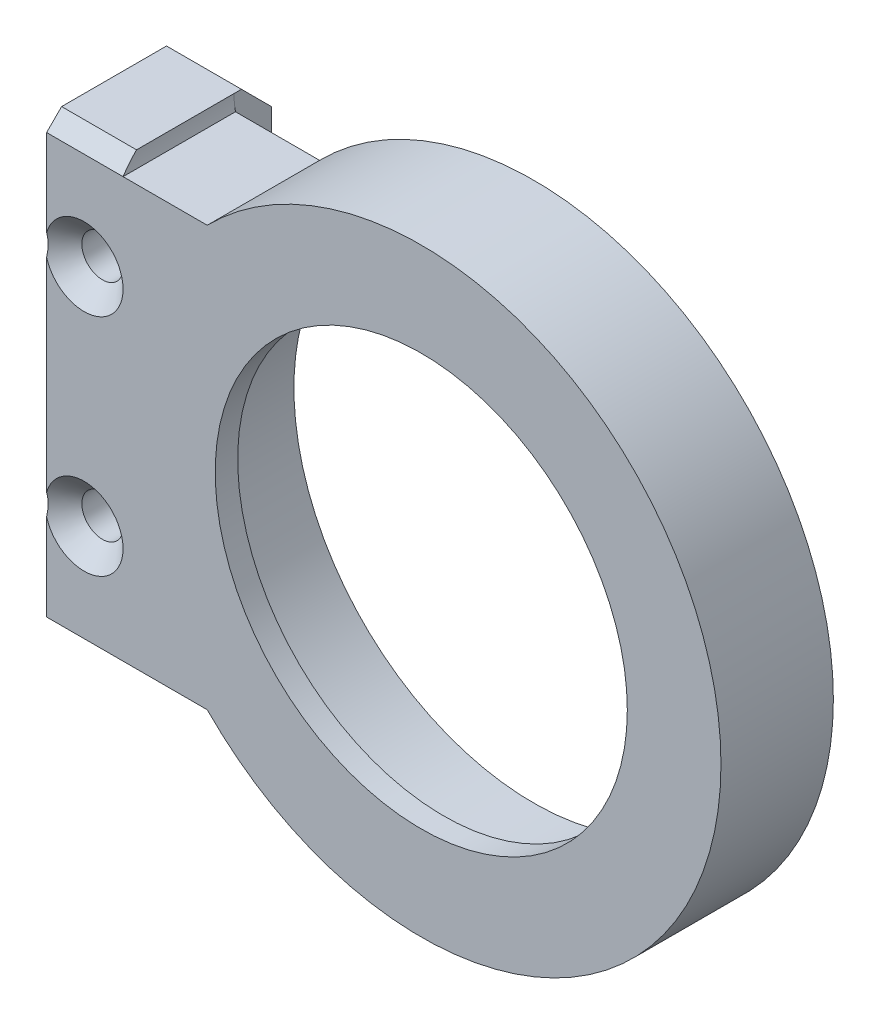
ISO-10303-21;
HEADER;
FILE_DESCRIPTION(('STEP AP214'),'2;1');
FILE_NAME('part.step','',(''),(''),'','','');
FILE_SCHEMA(('AUTOMOTIVE_DESIGN { 1 0 10303 214 1 1 1 1 }'));
ENDSEC;
DATA;
#1=APPLICATION_CONTEXT('core data for automotive mechanical design processes');
#2=APPLICATION_PROTOCOL_DEFINITION('international standard','automotive_design',2000,#1);
#3=PRODUCT_CONTEXT('',#1,'mechanical');
#4=PRODUCT('Part','Part','',(#3));
#5=PRODUCT_RELATED_PRODUCT_CATEGORY('part','',(#4));
#6=PRODUCT_DEFINITION_FORMATION('','',#4);
#7=PRODUCT_DEFINITION_CONTEXT('part definition',#1,'design');
#8=PRODUCT_DEFINITION('design','',#6,#7);
#9=PRODUCT_DEFINITION_SHAPE('','',#8);
#10=(LENGTH_UNIT() NAMED_UNIT(*) SI_UNIT(.MILLI.,.METRE.));
#11=(NAMED_UNIT(*) PLANE_ANGLE_UNIT() SI_UNIT($,.RADIAN.));
#12=(NAMED_UNIT(*) SI_UNIT($,.STERADIAN.) SOLID_ANGLE_UNIT());
#13=UNCERTAINTY_MEASURE_WITH_UNIT(LENGTH_MEASURE(1.E-05),#10,'distance_accuracy_value','');
#14=(GEOMETRIC_REPRESENTATION_CONTEXT(3) GLOBAL_UNCERTAINTY_ASSIGNED_CONTEXT((#13)) GLOBAL_UNIT_ASSIGNED_CONTEXT((#10,
#11,#12)) REPRESENTATION_CONTEXT('',''));
#15=CARTESIAN_POINT('',(0.,0.,0.));
#16=DIRECTION('',(0.,0.,1.));
#17=DIRECTION('',(1.,0.,0.));
#18=AXIS2_PLACEMENT_3D('',#15,#16,#17);
#19=CARTESIAN_POINT('',(0.,0.,15.));
#20=DIRECTION('',(0.,0.,-1.));
#21=DIRECTION('',(-1.,0.,0.));
#22=AXIS2_PLACEMENT_3D('',#19,#20,#21);
#23=PLANE('',#22);
#24=CARTESIAN_POINT('',(40.,40.,15.));
#25=DIRECTION('',(0.,0.,1.));
#26=DIRECTION('',(1.,0.,0.));
#27=AXIS2_PLACEMENT_3D('',#24,#25,#26);
#28=CIRCLE('',#27,27.5);
#29=CARTESIAN_POINT('',(67.5,40.,15.));
#30=VERTEX_POINT('',#29);
#31=EDGE_CURVE('E439',#30,#30,#28,.T.);
#32=ORIENTED_EDGE('',*,*,#31,.F.);
#33=EDGE_LOOP('',(#32));
#34=FACE_BOUND('',#33,.T.);
#35=CARTESIAN_POINT('',(40.,40.,15.));
#36=DIRECTION('',(0.,0.,1.));
#37=DIRECTION('',(1.,0.,0.));
#38=AXIS2_PLACEMENT_3D('',#35,#36,#37);
#39=CIRCLE('',#38,40.);
#40=CARTESIAN_POINT('',(11.4342862858286,12.,15.));
#41=VERTEX_POINT('',#40);
#42=CARTESIAN_POINT('',(11.4342862858286,68.,15.));
#43=VERTEX_POINT('',#42);
#44=EDGE_CURVE('E263',#41,#43,#39,.T.);
#45=ORIENTED_EDGE('',*,*,#44,.T.);
#46=DIRECTION('',(1.,0.,0.));
#47=VECTOR('',#46,1.);
#48=CARTESIAN_POINT('',(0.,68.,15.));
#49=LINE('',#48,#47);
#50=CARTESIAN_POINT('',(0.202041028867299,67.9999999999999,15.));
#51=VERTEX_POINT('',#50);
#52=EDGE_CURVE('E250',#51,#43,#49,.T.);
#53=ORIENTED_EDGE('',*,*,#52,.F.);
#54=DIRECTION('',(-1.,0.,0.));
#55=VECTOR('',#54,1.);
#56=CARTESIAN_POINT('',(-10.,68.,15.));
#57=LINE('',#56,#55);
#58=CARTESIAN_POINT('',(-10.,68.,15.));
#59=VERTEX_POINT('',#58);
#60=EDGE_CURVE('E259',#51,#59,#57,.T.);
#61=ORIENTED_EDGE('',*,*,#60,.T.);
#62=DIRECTION('',(0.,-1.,0.));
#63=VECTOR('',#62,1.);
#64=CARTESIAN_POINT('',(-10.,70.,15.));
#65=LINE('',#64,#63);
#66=CARTESIAN_POINT('',(-10.,56.4282856857086,15.));
#67=VERTEX_POINT('',#66);
#68=EDGE_CURVE('E427',#59,#67,#65,.T.);
#69=ORIENTED_EDGE('',*,*,#68,.T.);
#70=CARTESIAN_POINT('',(-5.,55.,15.));
#71=DIRECTION('',(0.,0.,1.));
#72=DIRECTION('',(1.,0.,0.));
#73=AXIS2_PLACEMENT_3D('',#70,#71,#72);
#74=CIRCLE('',#73,5.2);
#75=CARTESIAN_POINT('',(-10.,53.5717143142914,15.));
#76=VERTEX_POINT('',#75);
#77=EDGE_CURVE('E518',#76,#67,#74,.T.);
#78=ORIENTED_EDGE('',*,*,#77,.F.);
#79=CARTESIAN_POINT('',(-9.99999999999999,26.4282856857086,15.));
#80=VERTEX_POINT('',#79);
#81=EDGE_CURVE('E433',#76,#80,#65,.T.);
#82=ORIENTED_EDGE('',*,*,#81,.T.);
#83=CARTESIAN_POINT('',(-5.,25.,15.));
#84=DIRECTION('',(0.,0.,1.));
#85=DIRECTION('',(1.,0.,0.));
#86=AXIS2_PLACEMENT_3D('',#83,#84,#85);
#87=CIRCLE('',#86,5.2);
#88=CARTESIAN_POINT('',(-9.99999999999999,23.5717143142914,15.));
#89=VERTEX_POINT('',#88);
#90=EDGE_CURVE('E522',#89,#80,#87,.T.);
#91=ORIENTED_EDGE('',*,*,#90,.F.);
#92=CARTESIAN_POINT('',(-9.99999999999999,12.,15.));
#93=VERTEX_POINT('',#92);
#94=EDGE_CURVE('E434',#89,#93,#65,.T.);
#95=ORIENTED_EDGE('',*,*,#94,.T.);
#96=DIRECTION('',(1.,0.,0.));
#97=VECTOR('',#96,1.);
#98=CARTESIAN_POINT('',(0.,12.,15.));
#99=LINE('',#98,#97);
#100=CARTESIAN_POINT('',(0.202041028867287,12.,15.));
#101=VERTEX_POINT('',#100);
#102=EDGE_CURVE('E271',#93,#101,#99,.T.);
#103=ORIENTED_EDGE('',*,*,#102,.T.);
#104=DIRECTION('',(1.,0.,0.));
#105=VECTOR('',#104,1.);
#106=CARTESIAN_POINT('',(0.,12.,15.));
#107=LINE('',#106,#105);
#108=EDGE_CURVE('E550',#101,#41,#107,.T.);
#109=ORIENTED_EDGE('',*,*,#108,.T.);
#110=EDGE_LOOP('',(#45,#53,#61,#69,#78,#82,#91,#95,#103,#109));
#111=FACE_BOUND('',#110,.T.);
#112=ADVANCED_FACE('F115',(#34,#111),#23,.F.);
#113=CARTESIAN_POINT('',(0.,0.,0.));
#114=DIRECTION('',(0.,0.,-1.));
#115=DIRECTION('',(-1.,0.,0.));
#116=AXIS2_PLACEMENT_3D('',#113,#114,#115);
#117=PLANE('',#116);
#118=CARTESIAN_POINT('',(40.,40.,0.));
#119=DIRECTION('',(0.,0.,1.));
#120=DIRECTION('',(1.,0.,0.));
#121=AXIS2_PLACEMENT_3D('',#118,#119,#120);
#122=CIRCLE('',#121,32.);
#123=CARTESIAN_POINT('',(72.,40.,0.));
#124=VERTEX_POINT('',#123);
#125=EDGE_CURVE('E453',#124,#124,#122,.T.);
#126=ORIENTED_EDGE('',*,*,#125,.T.);
#127=EDGE_LOOP('',(#126));
#128=FACE_BOUND('',#127,.T.);
#129=DIRECTION('',(-1.,0.,0.));
#130=VECTOR('',#129,1.);
#131=CARTESIAN_POINT('',(0.,68.,0.));
#132=LINE('',#131,#130);
#133=CARTESIAN_POINT('',(11.4342862858286,68.,0.));
#134=VERTEX_POINT('',#133);
#135=CARTESIAN_POINT('',(0.202041028867299,67.9999999999999,0.));
#136=VERTEX_POINT('',#135);
#137=EDGE_CURVE('E252',#134,#136,#132,.T.);
#138=ORIENTED_EDGE('',*,*,#137,.F.);
#139=CARTESIAN_POINT('',(40.,40.,0.));
#140=DIRECTION('',(0.,0.,-1.));
#141=DIRECTION('',(-1.,0.,0.));
#142=AXIS2_PLACEMENT_3D('',#139,#140,#141);
#143=CIRCLE('',#142,40.);
#144=CARTESIAN_POINT('',(11.4342862858286,12.,0.));
#145=VERTEX_POINT('',#144);
#146=EDGE_CURVE('E12',#134,#145,#143,.T.);
#147=ORIENTED_EDGE('',*,*,#146,.T.);
#148=DIRECTION('',(-1.,0.,0.));
#149=VECTOR('',#148,1.);
#150=CARTESIAN_POINT('',(0.,12.,0.));
#151=LINE('',#150,#149);
#152=CARTESIAN_POINT('',(0.202041028867289,12.,0.));
#153=VERTEX_POINT('',#152);
#154=EDGE_CURVE('E416',#145,#153,#151,.T.);
#155=ORIENTED_EDGE('',*,*,#154,.T.);
#156=CARTESIAN_POINT('',(10.,10.,0.));
#157=DIRECTION('',(0.,0.,-1.));
#158=DIRECTION('',(-1.,0.,0.));
#159=AXIS2_PLACEMENT_3D('',#156,#157,#158);
#160=CIRCLE('',#159,10.);
#161=CARTESIAN_POINT('',(0.,10.,0.));
#162=VERTEX_POINT('',#161);
#163=EDGE_CURVE('E474',#162,#153,#160,.T.);
#164=ORIENTED_EDGE('',*,*,#163,.F.);
#165=DIRECTION('',(0.,-1.,0.));
#166=VECTOR('',#165,1.);
#167=CARTESIAN_POINT('',(0.,0.,0.));
#168=LINE('',#167,#166);
#169=CARTESIAN_POINT('',(0.,69.9999999999999,0.));
#170=VERTEX_POINT('',#169);
#171=EDGE_CURVE('E460',#170,#162,#168,.T.);
#172=ORIENTED_EDGE('',*,*,#171,.F.);
#173=CARTESIAN_POINT('',(10.,70.,0.));
#174=DIRECTION('',(0.,0.,-1.));
#175=DIRECTION('',(-1.,0.,0.));
#176=AXIS2_PLACEMENT_3D('',#173,#174,#175);
#177=CIRCLE('',#176,10.);
#178=EDGE_CURVE('E472',#136,#170,#177,.T.);
#179=ORIENTED_EDGE('',*,*,#178,.F.);
#180=EDGE_LOOP('',(#138,#147,#155,#164,#172,#179));
#181=FACE_BOUND('',#180,.T.);
#182=ADVANCED_FACE('F345',(#128,#181),#117,.T.);
#183=CARTESIAN_POINT('',(40.,40.,0.));
#184=DIRECTION('',(0.,0.,1.));
#185=DIRECTION('',(1.,0.,0.));
#186=AXIS2_PLACEMENT_3D('',#183,#184,#185);
#187=CYLINDRICAL_SURFACE('',#186,32.);
#188=ORIENTED_EDGE('',*,*,#125,.F.);
#189=EDGE_LOOP('',(#188));
#190=FACE_BOUND('',#189,.T.);
#191=CARTESIAN_POINT('',(40.,40.,12.));
#192=DIRECTION('',(0.,0.,1.));
#193=DIRECTION('',(1.,0.,0.));
#194=AXIS2_PLACEMENT_3D('',#191,#192,#193);
#195=CIRCLE('',#194,32.);
#196=CARTESIAN_POINT('',(72.,40.,12.));
#197=VERTEX_POINT('',#196);
#198=EDGE_CURVE('E464',#197,#197,#195,.F.);
#199=ORIENTED_EDGE('',*,*,#198,.F.);
#200=EDGE_LOOP('',(#199));
#201=FACE_BOUND('',#200,.T.);
#202=ADVANCED_FACE('F341',(#190,#201),#187,.F.);
#203=CARTESIAN_POINT('',(40.,40.,12.));
#204=DIRECTION('',(0.,0.,1.));
#205=DIRECTION('',(1.,0.,0.));
#206=AXIS2_PLACEMENT_3D('',#203,#204,#205);
#207=PLANE('',#206);
#208=CARTESIAN_POINT('',(40.,40.,12.));
#209=DIRECTION('',(0.,0.,1.));
#210=DIRECTION('',(1.,0.,0.));
#211=AXIS2_PLACEMENT_3D('',#208,#209,#210);
#212=CIRCLE('',#211,27.5);
#213=CARTESIAN_POINT('',(67.5,40.,12.));
#214=VERTEX_POINT('',#213);
#215=EDGE_CURVE('E449',#214,#214,#212,.T.);
#216=ORIENTED_EDGE('',*,*,#215,.T.);
#217=EDGE_LOOP('',(#216));
#218=FACE_BOUND('',#217,.T.);
#219=ORIENTED_EDGE('',*,*,#198,.T.);
#220=EDGE_LOOP('',(#219));
#221=FACE_BOUND('',#220,.T.);
#222=ADVANCED_FACE('F337',(#218,#221),#207,.F.);
#223=CARTESIAN_POINT('',(40.,40.,12.));
#224=DIRECTION('',(0.,0.,1.));
#225=DIRECTION('',(1.,0.,0.));
#226=AXIS2_PLACEMENT_3D('',#223,#224,#225);
#227=CYLINDRICAL_SURFACE('',#226,27.5);
#228=ORIENTED_EDGE('',*,*,#215,.F.);
#229=EDGE_LOOP('',(#228));
#230=FACE_BOUND('',#229,.T.);
#231=ORIENTED_EDGE('',*,*,#31,.T.);
#232=EDGE_LOOP('',(#231));
#233=FACE_BOUND('',#232,.T.);
#234=ADVANCED_FACE('F333',(#230,#233),#227,.F.);
#235=CARTESIAN_POINT('',(0.,69.9999999999999,-5.));
#236=DIRECTION('',(1.,0.,0.));
#237=DIRECTION('',(0.,0.,-1.));
#238=AXIS2_PLACEMENT_3D('',#235,#236,#237);
#239=PLANE('',#238);
#240=DIRECTION('',(0.,0.,1.));
#241=VECTOR('',#240,1.);
#242=CARTESIAN_POINT('',(0.,10.,-5.));
#243=LINE('',#242,#241);
#244=CARTESIAN_POINT('',(0.,10.,-1.00000000000001));
#245=VERTEX_POINT('',#244);
#246=EDGE_CURVE('E435',#245,#162,#243,.T.);
#247=ORIENTED_EDGE('',*,*,#246,.F.);
#248=DIRECTION('',(0.,-0.707106781186549,0.707106781186546));
#249=VECTOR('',#248,1.);
#250=CARTESIAN_POINT('',(0.,42.0000000000001,-33.));
#251=LINE('',#250,#249);
#252=CARTESIAN_POINT('',(0.,14.,-5.));
#253=VERTEX_POINT('',#252);
#254=EDGE_CURVE('E479',#245,#253,#251,.F.);
#255=ORIENTED_EDGE('',*,*,#254,.T.);
#256=DIRECTION('',(0.,1.,0.));
#257=VECTOR('',#256,1.);
#258=CARTESIAN_POINT('',(0.,69.9999999999999,-5.));
#259=LINE('',#258,#257);
#260=CARTESIAN_POINT('',(0.,65.9999999999999,-5.));
#261=VERTEX_POINT('',#260);
#262=EDGE_CURVE('E421',#253,#261,#259,.T.);
#263=ORIENTED_EDGE('',*,*,#262,.T.);
#264=DIRECTION('',(0.,-0.707106781186548,-0.707106781186548));
#265=VECTOR('',#264,1.);
#266=CARTESIAN_POINT('',(0.,67.9999999999999,-3.00000000000001));
#267=LINE('',#266,#265);
#268=CARTESIAN_POINT('',(0.,69.9999999999999,-1.00000000000001));
#269=VERTEX_POINT('',#268);
#270=EDGE_CURVE('E477',#261,#269,#267,.F.);
#271=ORIENTED_EDGE('',*,*,#270,.T.);
#272=DIRECTION('',(0.,0.,1.));
#273=VECTOR('',#272,1.);
#274=CARTESIAN_POINT('',(0.,69.9999999999999,-5.));
#275=LINE('',#274,#273);
#276=EDGE_CURVE('E425',#269,#170,#275,.T.);
#277=ORIENTED_EDGE('',*,*,#276,.T.);
#278=ORIENTED_EDGE('',*,*,#171,.T.);
#279=EDGE_LOOP('',(#247,#255,#263,#271,#277,#278));
#280=FACE_BOUND('',#279,.T.);
#281=ADVANCED_FACE('F330',(#280),#239,.T.);
#282=CARTESIAN_POINT('',(0.,10.,-5.));
#283=DIRECTION('',(0.,-1.,0.));
#284=DIRECTION('',(0.,0.,-1.));
#285=AXIS2_PLACEMENT_3D('',#282,#283,#284);
#286=PLANE('',#285);
#287=DIRECTION('',(0.,0.,1.));
#288=VECTOR('',#287,1.);
#289=CARTESIAN_POINT('',(-9.99999999999999,10.,-5.));
#290=LINE('',#289,#288);
#291=CARTESIAN_POINT('',(-9.99999999999999,10.,-1.00000000000001));
#292=VERTEX_POINT('',#291);
#293=CARTESIAN_POINT('',(-9.99999999999999,10.,13.));
#294=VERTEX_POINT('',#293);
#295=EDGE_CURVE('E440',#292,#294,#290,.T.);
#296=ORIENTED_EDGE('',*,*,#295,.F.);
#297=DIRECTION('',(1.,0.,0.));
#298=VECTOR('',#297,1.);
#299=CARTESIAN_POINT('',(0.,10.,-1.00000000000001));
#300=LINE('',#299,#298);
#301=EDGE_CURVE('E386',#292,#245,#300,.T.);
#302=ORIENTED_EDGE('',*,*,#301,.T.);
#303=ORIENTED_EDGE('',*,*,#246,.T.);
#304=DIRECTION('',(0.,0.,-1.));
#305=VECTOR('',#304,1.);
#306=CARTESIAN_POINT('',(0.,10.,15.));
#307=LINE('',#306,#305);
#308=CARTESIAN_POINT('',(0.,10.,13.));
#309=VERTEX_POINT('',#308);
#310=EDGE_CURVE('E272',#162,#309,#307,.F.);
#311=ORIENTED_EDGE('',*,*,#310,.T.);
#312=DIRECTION('',(-1.,0.,0.));
#313=VECTOR('',#312,1.);
#314=CARTESIAN_POINT('',(-9.99999999999999,10.,13.));
#315=LINE('',#314,#313);
#316=EDGE_CURVE('E277',#309,#294,#315,.T.);
#317=ORIENTED_EDGE('',*,*,#316,.T.);
#318=EDGE_LOOP('',(#296,#302,#303,#311,#317));
#319=FACE_BOUND('',#318,.T.);
#320=ADVANCED_FACE('F322',(#319),#286,.T.);
#321=CARTESIAN_POINT('',(-10.,70.,-5.));
#322=DIRECTION('',(-1.,0.,0.));
#323=DIRECTION('',(0.,-1.,0.));
#324=AXIS2_PLACEMENT_3D('',#321,#322,#323);
#325=PLANE('',#324);
#326=CARTESIAN_POINT('',(-10.,40.,-15.));
#327=DIRECTION('',(-1.,0.,0.));
#328=DIRECTION('',(0.,-1.,0.));
#329=AXIS2_PLACEMENT_3D('',#326,#327,#328);
#330=CIRCLE('',#329,15.);
#331=CARTESIAN_POINT('',(-9.99999999999999,28.8196601125011,-5.));
#332=VERTEX_POINT('',#331);
#333=CARTESIAN_POINT('',(-10.,51.180339887499,-5.));
#334=VERTEX_POINT('',#333);
#335=EDGE_CURVE('E407',#332,#334,#330,.T.);
#336=ORIENTED_EDGE('',*,*,#335,.F.);
#337=DIRECTION('',(0.,-1.,0.));
#338=VECTOR('',#337,1.);
#339=CARTESIAN_POINT('',(-10.,70.,-5.));
#340=LINE('',#339,#338);
#341=CARTESIAN_POINT('',(-9.99999999999999,14.,-5.));
#342=VERTEX_POINT('',#341);
#343=EDGE_CURVE('E412',#332,#342,#340,.T.);
#344=ORIENTED_EDGE('',*,*,#343,.T.);
#345=DIRECTION('',(0.,0.707106781186549,-0.707106781186546));
#346=VECTOR('',#345,1.);
#347=CARTESIAN_POINT('',(-10.,42.0000000000001,-33.));
#348=LINE('',#347,#346);
#349=EDGE_CURVE('E382',#342,#292,#348,.F.);
#350=ORIENTED_EDGE('',*,*,#349,.T.);
#351=ORIENTED_EDGE('',*,*,#295,.T.);
#352=DIRECTION('',(0.,0.707106781186545,0.70710678118655));
#353=VECTOR('',#352,1.);
#354=CARTESIAN_POINT('',(-9.99999999999999,30.9999999999998,33.9999999999999));
#355=LINE('',#354,#353);
#356=EDGE_CURVE('E288',#294,#93,#355,.T.);
#357=ORIENTED_EDGE('',*,*,#356,.T.);
#358=ORIENTED_EDGE('',*,*,#94,.F.);
#359=CARTESIAN_POINT('',(-9.99999999999999,7.8594311095646,27.6549461463137));
#360=CARTESIAN_POINT('',(-9.99999999999999,8.28416255769191,27.2472450098931));
#361=CARTESIAN_POINT('',(-9.99999999999999,8.70945387927048,26.8401244323223));
#362=CARTESIAN_POINT('',(-9.99999999999999,9.56154487950488,26.0274201074976));
#363=CARTESIAN_POINT('',(-9.99999999999999,9.98834463672727,25.621836442643));
#364=CARTESIAN_POINT('',(-9.99999999999999,10.8449804498971,24.8115046932619));
#365=CARTESIAN_POINT('',(-9.99999999999999,11.2748216406091,24.4067620307531));
#366=CARTESIAN_POINT('',(-9.99999999999999,12.1368987880679,23.5998676629642));
#367=CARTESIAN_POINT('',(-9.99999999999999,12.5691346513957,23.197715857917));
#368=CARTESIAN_POINT('',(-9.99999999999999,13.4885147936776,22.3490700908305));
#369=CARTESIAN_POINT('',(-9.99999999999999,13.9760592526751,21.9030082340218));
#370=CARTESIAN_POINT('',(-9.99999999999999,14.7116102588215,21.2385324689809));
#371=CARTESIAN_POINT('',(-9.99999999999999,14.9575171457645,21.0177946400969));
#372=CARTESIAN_POINT('',(-9.99999999999999,15.4510302057701,20.5782281112408));
#373=CARTESIAN_POINT('',(-9.99999999999999,15.6986363664522,20.3593993973858));
#374=CARTESIAN_POINT('',(-9.99999999999999,16.1955173969748,19.9244510156428));
#375=CARTESIAN_POINT('',(-9.99999999999999,16.4447889484435,19.7083275616086));
#376=CARTESIAN_POINT('',(-9.99999999999999,16.9458689452639,19.2790457830003));
#377=CARTESIAN_POINT('',(-9.99999999999999,17.1976773410219,19.0658874006541));
#378=CARTESIAN_POINT('',(-9.99999999999999,17.7044132236852,18.643415990683));
#379=CARTESIAN_POINT('',(-9.99999999999999,17.9593400233216,18.4341021403176));
#380=CARTESIAN_POINT('',(-9.99999999999999,18.4731945565331,18.0204556387426));
#381=CARTESIAN_POINT('',(-9.99999999999999,18.7321220149816,17.8161226474669));
#382=CARTESIAN_POINT('',(-9.99999999999999,19.1611358397914,17.4864100174417));
#383=CARTESIAN_POINT('',(-9.99999999999999,19.3297005004632,17.3590520620378));
#384=CARTESIAN_POINT('',(-9.99999999999999,19.6693493609622,17.107719744443));
#385=CARTESIAN_POINT('',(-9.99999999999999,19.8404336387524,16.983745487292));
#386=CARTESIAN_POINT('',(-9.99999999999999,20.1858986855652,16.7397826427711));
#387=CARTESIAN_POINT('',(-9.99999999999999,20.3602848967737,16.6198017353629));
#388=CARTESIAN_POINT('',(-9.99999999999999,20.7126109548291,16.3851670625989));
#389=CARTESIAN_POINT('',(-9.99999999999999,20.8905506395272,16.2705130549616));
#390=CARTESIAN_POINT('',(-9.99999999999999,21.2469861864799,16.0502699042189));
#391=CARTESIAN_POINT('',(-9.99999999999999,21.4253968392505,15.9445436578861));
#392=CARTESIAN_POINT('',(-9.99999999999999,21.7870157213599,15.7414541593591));
#393=CARTESIAN_POINT('',(-9.99999999999999,21.9702251235772,15.6440929770623));
#394=CARTESIAN_POINT('',(-9.99999999999999,22.3414952285317,15.4605376181867));
#395=CARTESIAN_POINT('',(-9.99999999999999,22.5295390328312,15.3743095853939));
#396=CARTESIAN_POINT('',(-9.99999999999999,22.9114037054313,15.2159134799892));
#397=CARTESIAN_POINT('',(-9.99999999999999,23.1052198338,15.1437342193307));
#398=CARTESIAN_POINT('',(-9.99999999999999,23.4262429895185,15.0405016336706));
#399=CARTESIAN_POINT('',(-9.99999999999999,23.5517278424753,15.0040867135263));
#400=CARTESIAN_POINT('',(-9.99999999999999,23.8048177777684,14.9394064611319));
#401=CARTESIAN_POINT('',(-9.99999999999999,23.9324230517172,14.911141869671));
#402=CARTESIAN_POINT('',(-9.99999999999999,24.1889904485045,14.8637825558888));
#403=CARTESIAN_POINT('',(-9.99999999999999,24.317948049089,14.8446635967391));
#404=CARTESIAN_POINT('',(-9.99999999999999,24.5769371979581,14.8162150237997));
#405=CARTESIAN_POINT('',(-9.99999999999999,24.7069686792413,14.8068848038529));
#406=CARTESIAN_POINT('',(-9.99999999999999,24.9952754785205,14.7975090691851));
#407=CARTESIAN_POINT('',(-9.99999999999999,25.1536362005214,14.7998796347131));
#408=CARTESIAN_POINT('',(-9.99999999999999,25.4694279022083,14.8195120069197));
#409=CARTESIAN_POINT('',(-9.99999999999999,25.6268587450692,14.8367759526731));
#410=CARTESIAN_POINT('',(-9.99999999999999,25.9401910566238,14.8852616151982));
#411=CARTESIAN_POINT('',(-9.99999999999999,26.0960835558126,14.9165405263141));
#412=CARTESIAN_POINT('',(-9.99999999999999,26.4048316394755,14.9914455431218));
#413=CARTESIAN_POINT('',(-9.99999999999999,26.5576868552822,15.0350731380247));
#414=CARTESIAN_POINT('',(-9.99999999999999,27.0090455774692,15.1810262884109));
#415=CARTESIAN_POINT('',(-9.99999999999999,27.3025787273957,15.2988179616917));
#416=CARTESIAN_POINT('',(-9.99999999999999,27.7328660017739,15.4966944369798));
#417=CARTESIAN_POINT('',(-9.99999999999999,27.8747627325166,15.5662646766619));
#418=CARTESIAN_POINT('',(-9.99999999999999,28.1555395722183,15.7112584291149));
#419=CARTESIAN_POINT('',(-9.99999999999999,28.2944201095908,15.7866811035669));
#420=CARTESIAN_POINT('',(-9.99999999999999,28.5713999519271,15.9434253469254));
#421=CARTESIAN_POINT('',(-9.99999999999999,28.7094600280379,16.0248155762936));
#422=CARTESIAN_POINT('',(-9.99999999999999,28.9830997137161,16.1916607692821));
#423=CARTESIAN_POINT('',(-9.99999999999999,29.118679270874,16.2771158186487));
#424=CARTESIAN_POINT('',(-9.99999999999999,29.3875377590467,16.45131623394));
#425=CARTESIAN_POINT('',(-9.99999999999999,29.5208185378889,16.540058757526));
#426=CARTESIAN_POINT('',(-9.99999999999999,29.7854554942098,16.7203488625712));
#427=CARTESIAN_POINT('',(-9.99999999999999,29.9168117507728,16.8118963282864));
#428=CARTESIAN_POINT('',(-9.99999999999999,30.3471268087106,17.1175839376333));
#429=CARTESIAN_POINT('',(-9.99999999999999,30.6425226389314,17.3367415382127));
#430=CARTESIAN_POINT('',(-9.99999999999999,31.2268039042214,17.7835971372859));
#431=CARTESIAN_POINT('',(-9.99999999999999,31.5156880637803,18.0112967861245));
#432=CARTESIAN_POINT('',(-9.99999999999999,32.0886761063362,18.4729776871843));
#433=CARTESIAN_POINT('',(-10.,32.372776891414,18.7069627734305));
#434=CARTESIAN_POINT('',(-10.,32.9371353506225,19.1794642382185));
#435=CARTESIAN_POINT('',(-10.,33.2173933118146,19.4179802750851));
#436=CARTESIAN_POINT('',(-10.,33.775658574937,19.8991141453604));
#437=CARTESIAN_POINT('',(-10.,34.0536579240796,20.1417411890543));
#438=CARTESIAN_POINT('',(-10.,34.6072702282067,20.6297074979111));
#439=CARTESIAN_POINT('',(-10.,34.8828831441466,20.8750468073007));
#440=CARTESIAN_POINT('',(-10.,35.4320816152624,21.3677841351746));
#441=CARTESIAN_POINT('',(-10.,35.7056678636726,21.6151813818229));
#442=CARTESIAN_POINT('',(-10.,36.2512637596094,22.1117091411918));
#443=CARTESIAN_POINT('',(-10.,36.5232733998255,22.3608396619376));
#444=CARTESIAN_POINT('',(-10.,37.2709381009922,23.0491967140095));
#445=CARTESIAN_POINT('',(-10.,37.7452426863505,23.4898897526554));
#446=CARTESIAN_POINT('',(-10.,38.6909654434033,24.3744535138539));
#447=CARTESIAN_POINT('',(-10.,39.1623833121889,24.8183245596289));
#448=CARTESIAN_POINT('',(-10.,40.1006990436849,25.7062286205611));
#449=CARTESIAN_POINT('',(-10.,40.5676077360365,26.1502502010019));
#450=CARTESIAN_POINT('',(-10.,41.4996390215577,27.0400506973058));
#451=CARTESIAN_POINT('',(-10.,41.9647618262949,27.485829391481));
#452=CARTESIAN_POINT('',(-10.,42.4292534504211,27.9322606378525));
#453=B_SPLINE_CURVE_WITH_KNOTS('',3,(#359,#360,#361,#362,#363,#364,#365,#366,#367,#368,#369,
#370,#371,#372,#373,#374,#375,#376,#377,#378,#379,#380,#381,#382,#383,#384,#385,#386,#387,#388,
#389,#390,#391,#392,#393,#394,#395,#396,#397,#398,#399,#400,#401,#402,#403,#404,#405,#406,#407,
#408,#409,#410,#411,#412,#413,#414,#415,#416,#417,#418,#419,#420,#421,#422,#423,#424,#425,#426,
#427,#428,#429,#430,#431,#432,#433,#434,#435,#436,#437,#438,#439,#440,#441,#442,#443,#444,#445,
#446,#447,#448,#449,#450,#451,#452),.UNSPECIFIED.,.F.,.F.,(4,2,2,2,2,2,2,2,2,2,2,2,2,2,2,2,2,2,
2,2,2,2,2,2,2,2,2,2,2,2,2,2,2,2,2,2,2,2,2,2,2,2,2,2,2,2,4),(0.,1.76622786818039,3.5325491270969,
5.30376049243499,7.07490324048938,9.05729193480285,10.0486261729348,11.0399531961451,
12.0296882325512,13.0194039576862,14.0089053533404,14.9983390009097,15.6321095938035,
16.2658998384679,16.9008457795972,17.5357628133768,18.157742812893,18.779876277952,
19.4000708718358,20.0197695210031,20.4115253187975,20.8033167123486,21.1940639875419,
21.5847870647033,22.0591798013701,22.53364068446,23.0100557066807,23.4865282074962,
24.4327241030442,24.9067676938962,25.3807435063376,25.8614629525118,26.3421925438374,
26.8225157781252,27.3028192188247,28.4060062914135,29.5094076114018,30.6134979994025,
31.717505456796,32.8244445683253,33.9314017565347,35.0379609825212,36.1445253353222,
38.0868153871105,40.0293058699437,41.9622851597255,43.895027917229),.UNSPECIFIED.);
#454=EDGE_CURVE('E242',#80,#89,#453,.F.);
#455=ORIENTED_EDGE('',*,*,#454,.F.);
#456=ORIENTED_EDGE('',*,*,#81,.F.);
#457=CARTESIAN_POINT('',(-10.,37.8594311095646,27.6549461463137));
#458=CARTESIAN_POINT('',(-10.,38.2841625576919,27.2472450098931));
#459=CARTESIAN_POINT('',(-10.,38.7094538792705,26.8401244323223));
#460=CARTESIAN_POINT('',(-10.,39.5615448795049,26.0274201074976));
#461=CARTESIAN_POINT('',(-10.,39.9883446367273,25.621836442643));
#462=CARTESIAN_POINT('',(-10.,40.8449804498971,24.8115046932619));
#463=CARTESIAN_POINT('',(-10.,41.2748216406091,24.4067620307531));
#464=CARTESIAN_POINT('',(-10.,42.1368987880679,23.5998676629642));
#465=CARTESIAN_POINT('',(-10.,42.5691346513957,23.1977158579171));
#466=CARTESIAN_POINT('',(-10.,43.4885147936776,22.3490700908305));
#467=CARTESIAN_POINT('',(-10.,43.976059252675,21.9030082340219));
#468=CARTESIAN_POINT('',(-10.,44.7116102588215,21.238532468981));
#469=CARTESIAN_POINT('',(-10.,44.9575171457645,21.017794640097));
#470=CARTESIAN_POINT('',(-10.,45.45103020577,20.5782281112409));
#471=CARTESIAN_POINT('',(-10.,45.6986363664521,20.3593993973858));
#472=CARTESIAN_POINT('',(-10.,46.1955173969748,19.9244510156428));
#473=CARTESIAN_POINT('',(-10.,46.4447889484435,19.7083275616087));
#474=CARTESIAN_POINT('',(-10.,46.9458689452638,19.2790457830003));
#475=CARTESIAN_POINT('',(-10.,47.1976773410219,19.0658874006541));
#476=CARTESIAN_POINT('',(-10.,47.7044132236852,18.643415990683));
#477=CARTESIAN_POINT('',(-10.,47.9593400233216,18.4341021403176));
#478=CARTESIAN_POINT('',(-10.,48.473194556533,18.0204556387426));
#479=CARTESIAN_POINT('',(-10.,48.7321220149815,17.816122647467));
#480=CARTESIAN_POINT('',(-10.,49.1611358397913,17.4864100174417));
#481=CARTESIAN_POINT('',(-10.,49.3297005004632,17.3590520620378));
#482=CARTESIAN_POINT('',(-10.,49.6693493609622,17.107719744443));
#483=CARTESIAN_POINT('',(-10.,49.8404336387524,16.983745487292));
#484=CARTESIAN_POINT('',(-10.,50.1858986855651,16.7397826427711));
#485=CARTESIAN_POINT('',(-10.,50.3602848967737,16.6198017353629));
#486=CARTESIAN_POINT('',(-10.,50.7126109548291,16.3851670625989));
#487=CARTESIAN_POINT('',(-10.,50.8905506395271,16.2705130549616));
#488=CARTESIAN_POINT('',(-10.,51.2469861864799,16.0502699042189));
#489=CARTESIAN_POINT('',(-10.,51.4253968392505,15.9445436578861));
#490=CARTESIAN_POINT('',(-10.,51.7870157213599,15.7414541593591));
#491=CARTESIAN_POINT('',(-10.,51.9702251235772,15.6440929770623));
#492=CARTESIAN_POINT('',(-10.,52.3414952285317,15.4605376181867));
#493=CARTESIAN_POINT('',(-10.,52.5295390328312,15.3743095853939));
#494=CARTESIAN_POINT('',(-10.,52.9114037054313,15.2159134799892));
#495=CARTESIAN_POINT('',(-10.,53.1052198338,15.1437342193307));
#496=CARTESIAN_POINT('',(-10.,53.4262429895185,15.0405016336706));
#497=CARTESIAN_POINT('',(-10.,53.5517278424753,15.0040867135263));
#498=CARTESIAN_POINT('',(-10.,53.8048177777684,14.9394064611319));
#499=CARTESIAN_POINT('',(-10.,53.9324230517172,14.911141869671));
#500=CARTESIAN_POINT('',(-10.,54.1889904485045,14.8637825558888));
#501=CARTESIAN_POINT('',(-10.,54.317948049089,14.8446635967391));
#502=CARTESIAN_POINT('',(-10.,54.5769371979581,14.8162150237997));
#503=CARTESIAN_POINT('',(-10.,54.7069686792413,14.8068848038529));
#504=CARTESIAN_POINT('',(-10.,54.9952754785205,14.7975090691851));
#505=CARTESIAN_POINT('',(-10.,55.1536362005214,14.7998796347131));
#506=CARTESIAN_POINT('',(-10.,55.4694279022083,14.8195120069197));
#507=CARTESIAN_POINT('',(-10.,55.6268587450692,14.8367759526731));
#508=CARTESIAN_POINT('',(-10.,55.9401910566238,14.8852616151982));
#509=CARTESIAN_POINT('',(-10.,56.0960835558126,14.9165405263141));
#510=CARTESIAN_POINT('',(-10.,56.4048316394754,14.9914455431218));
#511=CARTESIAN_POINT('',(-10.,56.5576868552822,15.0350731380247));
#512=CARTESIAN_POINT('',(-10.,57.0090455774692,15.1810262884109));
#513=CARTESIAN_POINT('',(-10.,57.3025787273957,15.2988179616917));
#514=CARTESIAN_POINT('',(-10.,57.7328660017739,15.4966944369798));
#515=CARTESIAN_POINT('',(-10.,57.8747627325166,15.5662646766619));
#516=CARTESIAN_POINT('',(-10.,58.1555395722183,15.7112584291149));
#517=CARTESIAN_POINT('',(-10.,58.2944201095908,15.7866811035669));
#518=CARTESIAN_POINT('',(-10.,58.5713999519271,15.9434253469254));
#519=CARTESIAN_POINT('',(-10.,58.7094600280379,16.0248155762936));
#520=CARTESIAN_POINT('',(-10.,58.9830997137161,16.1916607692821));
#521=CARTESIAN_POINT('',(-10.,59.1186792708741,16.2771158186487));
#522=CARTESIAN_POINT('',(-10.,59.3875377590467,16.45131623394));
#523=CARTESIAN_POINT('',(-10.,59.5208185378889,16.540058757526));
#524=CARTESIAN_POINT('',(-10.,59.7854554942098,16.7203488625712));
#525=CARTESIAN_POINT('',(-10.,59.9168117507728,16.8118963282865));
#526=CARTESIAN_POINT('',(-10.,60.3471268087106,17.1175839376333));
#527=CARTESIAN_POINT('',(-10.,60.6425226389315,17.3367415382127));
#528=CARTESIAN_POINT('',(-10.,61.2268039042214,17.7835971372859));
#529=CARTESIAN_POINT('',(-10.,61.5156880637804,18.0112967861245));
#530=CARTESIAN_POINT('',(-10.,62.0886761063363,18.4729776871843));
#531=CARTESIAN_POINT('',(-10.,62.372776891414,18.7069627734305));
#532=CARTESIAN_POINT('',(-10.,62.9371353506225,19.1794642382186));
#533=CARTESIAN_POINT('',(-10.,63.2173933118147,19.4179802750851));
#534=CARTESIAN_POINT('',(-10.,63.7756585749371,19.8991141453604));
#535=CARTESIAN_POINT('',(-10.,64.0536579240796,20.1417411890544));
#536=CARTESIAN_POINT('',(-10.,64.6072702282068,20.6297074979112));
#537=CARTESIAN_POINT('',(-10.,64.8828831441466,20.8750468073007));
#538=CARTESIAN_POINT('',(-10.,65.4320816152624,21.3677841351747));
#539=CARTESIAN_POINT('',(-10.,65.7056678636726,21.615181381823));
#540=CARTESIAN_POINT('',(-10.,66.2512637596094,22.1117091411919));
#541=CARTESIAN_POINT('',(-10.,66.5232733998256,22.3608396619376));
#542=CARTESIAN_POINT('',(-10.,67.2709381009922,23.0491967140096));
#543=CARTESIAN_POINT('',(-10.,67.7452426863505,23.4898897526555));
#544=CARTESIAN_POINT('',(-10.,68.6909654434033,24.3744535138539));
#545=CARTESIAN_POINT('',(-10.,69.1623833121889,24.8183245596289));
#546=CARTESIAN_POINT('',(-10.,70.100699043685,25.7062286205611));
#547=CARTESIAN_POINT('',(-10.,70.5676077360366,26.1502502010019));
#548=CARTESIAN_POINT('',(-10.,71.4996390215577,27.0400506973059));
#549=CARTESIAN_POINT('',(-10.,71.964761826295,27.4858293914811));
#550=CARTESIAN_POINT('',(-10.,72.4292534504212,27.9322606378526));
#551=B_SPLINE_CURVE_WITH_KNOTS('',3,(#457,#458,#459,#460,#461,#462,#463,#464,#465,#466,#467,
#468,#469,#470,#471,#472,#473,#474,#475,#476,#477,#478,#479,#480,#481,#482,#483,#484,#485,#486,
#487,#488,#489,#490,#491,#492,#493,#494,#495,#496,#497,#498,#499,#500,#501,#502,#503,#504,#505,
#506,#507,#508,#509,#510,#511,#512,#513,#514,#515,#516,#517,#518,#519,#520,#521,#522,#523,#524,
#525,#526,#527,#528,#529,#530,#531,#532,#533,#534,#535,#536,#537,#538,#539,#540,#541,#542,#543,
#544,#545,#546,#547,#548,#549,#550),.UNSPECIFIED.,.F.,.F.,(4,2,2,2,2,2,2,2,2,2,2,2,2,2,2,2,2,2,
2,2,2,2,2,2,2,2,2,2,2,2,2,2,2,2,2,2,2,2,2,2,2,2,2,2,2,2,4),(0.,1.76622786818039,
3.53254912709689,5.30376049243497,7.07490324048936,9.05729193480282,10.0486261729348,
11.0399531961451,12.0296882325512,13.0194039576862,14.0089053533404,14.9983390009097,
15.6321095938035,16.2658998384679,16.9008457795972,17.5357628133768,18.157742812893,
18.779876277952,19.4000708718358,20.0197695210031,20.4115253187975,20.8033167123486,
21.1940639875419,21.5847870647033,22.0591798013701,22.5336406844601,23.0100557066807,
23.4865282074962,24.4327241030443,24.9067676938962,25.3807435063376,25.8614629525118,
26.3421925438374,26.8225157781252,27.3028192188247,28.4060062914135,29.5094076114019,
30.6134979994025,31.717505456796,32.8244445683254,33.9314017565347,35.0379609825213,
36.1445253353222,38.0868153871106,40.0293058699438,41.9622851597256,43.8950279172291),.UNSPECIFIED.);
#552=EDGE_CURVE('E305',#67,#76,#551,.F.);
#553=ORIENTED_EDGE('',*,*,#552,.F.);
#554=ORIENTED_EDGE('',*,*,#68,.F.);
#555=DIRECTION('',(0.,0.70710678118654,-0.707106781186555));
#556=VECTOR('',#555,1.);
#557=CARTESIAN_POINT('',(-10.,79.,3.9999999999998));
#558=LINE('',#557,#556);
#559=CARTESIAN_POINT('',(-10.,70.,13.));
#560=VERTEX_POINT('',#559);
#561=EDGE_CURVE('E269',#59,#560,#558,.T.);
#562=ORIENTED_EDGE('',*,*,#561,.T.);
#563=DIRECTION('',(0.,0.,1.));
#564=VECTOR('',#563,1.);
#565=CARTESIAN_POINT('',(-10.,70.,-5.));
#566=LINE('',#565,#564);
#567=CARTESIAN_POINT('',(-10.,70.,-1.00000000000001));
#568=VERTEX_POINT('',#567);
#569=EDGE_CURVE('E443',#568,#560,#566,.T.);
#570=ORIENTED_EDGE('',*,*,#569,.F.);
#571=DIRECTION('',(0.,0.707106781186548,0.707106781186548));
#572=VECTOR('',#571,1.);
#573=CARTESIAN_POINT('',(-10.,68.,-3.00000000000001));
#574=LINE('',#573,#572);
#575=CARTESIAN_POINT('',(-10.,66.,-5.));
#576=VERTEX_POINT('',#575);
#577=EDGE_CURVE('E139',#568,#576,#574,.F.);
#578=ORIENTED_EDGE('',*,*,#577,.T.);
#579=EDGE_CURVE('E414',#576,#334,#340,.T.);
#580=ORIENTED_EDGE('',*,*,#579,.T.);
#581=EDGE_LOOP('',(#336,#344,#350,#351,#357,#358,#455,#456,#553,#554,#562,#570,#578,#580));
#582=FACE_BOUND('',#581,.T.);
#583=ADVANCED_FACE('F316',(#582),#325,.T.);
#584=CARTESIAN_POINT('',(0.,69.9999999999999,-5.));
#585=DIRECTION('',(0.,1.,0.));
#586=DIRECTION('',(-1.,0.,0.));
#587=AXIS2_PLACEMENT_3D('',#584,#585,#586);
#588=PLANE('',#587);
#589=ORIENTED_EDGE('',*,*,#276,.F.);
#590=DIRECTION('',(-1.,0.,0.));
#591=VECTOR('',#590,1.);
#592=CARTESIAN_POINT('',(0.,69.9999999999999,-1.00000000000001));
#593=LINE('',#592,#591);
#594=EDGE_CURVE('E389',#269,#568,#593,.T.);
#595=ORIENTED_EDGE('',*,*,#594,.T.);
#596=ORIENTED_EDGE('',*,*,#569,.T.);
#597=DIRECTION('',(1.,0.,0.));
#598=VECTOR('',#597,1.);
#599=CARTESIAN_POINT('',(0.,69.9999999999999,13.));
#600=LINE('',#599,#598);
#601=CARTESIAN_POINT('',(0.,70.,12.9999999999999));
#602=VERTEX_POINT('',#601);
#603=EDGE_CURVE('E292',#560,#602,#600,.T.);
#604=ORIENTED_EDGE('',*,*,#603,.T.);
#605=DIRECTION('',(0.,0.,-1.));
#606=VECTOR('',#605,1.);
#607=CARTESIAN_POINT('',(0.,70.,15.));
#608=LINE('',#607,#606);
#609=EDGE_CURVE('E236',#602,#170,#608,.T.);
#610=ORIENTED_EDGE('',*,*,#609,.T.);
#611=EDGE_LOOP('',(#589,#595,#596,#604,#610));
#612=FACE_BOUND('',#611,.T.);
#613=ADVANCED_FACE('F321',(#612),#588,.T.);
#614=CARTESIAN_POINT('',(0.,0.,-5.));
#615=DIRECTION('',(0.,0.,-1.));
#616=DIRECTION('',(-1.,0.,0.));
#617=AXIS2_PLACEMENT_3D('',#614,#615,#616);
#618=PLANE('',#617);
#619=DIRECTION('',(-1.,0.,0.));
#620=VECTOR('',#619,1.);
#621=CARTESIAN_POINT('',(-7.99999999999999,28.8196601125011,-5.));
#622=LINE('',#621,#620);
#623=CARTESIAN_POINT('',(-7.99999999999999,28.8196601125011,-5.));
#624=VERTEX_POINT('',#623);
#625=EDGE_CURVE('E125',#624,#332,#622,.T.);
#626=ORIENTED_EDGE('',*,*,#625,.F.);
#627=DIRECTION('',(0.,1.,0.));
#628=VECTOR('',#627,1.);
#629=CARTESIAN_POINT('',(-7.99999999999999,0.,-5.));
#630=LINE('',#629,#628);
#631=CARTESIAN_POINT('',(-8.,51.180339887499,-5.));
#632=VERTEX_POINT('',#631);
#633=EDGE_CURVE('E393',#624,#632,#630,.T.);
#634=ORIENTED_EDGE('',*,*,#633,.T.);
#635=DIRECTION('',(-1.,0.,0.));
#636=VECTOR('',#635,1.);
#637=CARTESIAN_POINT('',(-8.,51.180339887499,-5.));
#638=LINE('',#637,#636);
#639=EDGE_CURVE('E401',#334,#632,#638,.F.);
#640=ORIENTED_EDGE('',*,*,#639,.F.);
#641=ORIENTED_EDGE('',*,*,#579,.F.);
#642=DIRECTION('',(1.,0.,0.));
#643=VECTOR('',#642,1.);
#644=CARTESIAN_POINT('',(4.57966997657877E-13,65.9999999999999,-5.));
#645=LINE('',#644,#643);
#646=EDGE_CURVE('E483',#576,#261,#645,.T.);
#647=ORIENTED_EDGE('',*,*,#646,.T.);
#648=ORIENTED_EDGE('',*,*,#262,.F.);
#649=DIRECTION('',(-1.,0.,0.));
#650=VECTOR('',#649,1.);
#651=CARTESIAN_POINT('',(0.,14.,-5.));
#652=LINE('',#651,#650);
#653=EDGE_CURVE('E384',#253,#342,#652,.T.);
#654=ORIENTED_EDGE('',*,*,#653,.T.);
#655=ORIENTED_EDGE('',*,*,#343,.F.);
#656=EDGE_LOOP('',(#626,#634,#640,#641,#647,#648,#654,#655));
#657=FACE_BOUND('',#656,.T.);
#658=CARTESIAN_POINT('',(-5.,55.,-5.));
#659=DIRECTION('',(0.,0.,1.));
#660=DIRECTION('',(1.,0.,0.));
#661=AXIS2_PLACEMENT_3D('',#658,#659,#660);
#662=CIRCLE('',#661,2.75);
#663=CARTESIAN_POINT('',(-2.25,55.,-5.));
#664=VERTEX_POINT('',#663);
#665=EDGE_CURVE('E512',#664,#664,#662,.T.);
#666=ORIENTED_EDGE('',*,*,#665,.T.);
#667=EDGE_LOOP('',(#666));
#668=FACE_BOUND('',#667,.T.);
#669=CARTESIAN_POINT('',(-5.,25.,-5.));
#670=DIRECTION('',(0.,0.,1.));
#671=DIRECTION('',(1.,0.,0.));
#672=AXIS2_PLACEMENT_3D('',#669,#670,#671);
#673=CIRCLE('',#672,2.75);
#674=CARTESIAN_POINT('',(-2.25,25.,-5.));
#675=VERTEX_POINT('',#674);
#676=EDGE_CURVE('E532',#675,#675,#673,.T.);
#677=ORIENTED_EDGE('',*,*,#676,.T.);
#678=EDGE_LOOP('',(#677));
#679=FACE_BOUND('',#678,.T.);
#680=ADVANCED_FACE('F328',(#657,#668,#679),#618,.T.);
#681=CARTESIAN_POINT('',(0.,12.,15.));
#682=DIRECTION('',(0.,-0.70710678118655,0.707106781186545));
#683=DIRECTION('',(-1.,0.,0.));
#684=AXIS2_PLACEMENT_3D('',#681,#682,#683);
#685=PLANE('',#684);
#686=ORIENTED_EDGE('',*,*,#356,.F.);
#687=ORIENTED_EDGE('',*,*,#316,.F.);
#688=CARTESIAN_POINT('',(10.,10.,13.));
#689=DIRECTION('',(0.,-0.70710678118655,0.707106781186545));
#690=DIRECTION('',(0.,-0.707106781186545,-0.70710678118655));
#691=AXIS2_PLACEMENT_3D('',#688,#689,#690);
#692=ELLIPSE('',#691,14.142135623731,10.);
#693=EDGE_CURVE('E243',#101,#309,#692,.T.);
#694=ORIENTED_EDGE('',*,*,#693,.F.);
#695=ORIENTED_EDGE('',*,*,#102,.F.);
#696=EDGE_LOOP('',(#686,#687,#694,#695));
#697=FACE_BOUND('',#696,.T.);
#698=ADVANCED_FACE('F354',(#697),#685,.T.);
#699=CARTESIAN_POINT('',(4.71844785465691E-13,67.9999999999999,15.));
#700=DIRECTION('',(0.,0.707106781186555,0.70710678118654));
#701=DIRECTION('',(1.,0.,0.));
#702=AXIS2_PLACEMENT_3D('',#699,#700,#701);
#703=PLANE('',#702);
#704=CARTESIAN_POINT('',(10.,70.,12.9999999999998));
#705=DIRECTION('',(0.,0.707106781186555,0.70710678118654));
#706=DIRECTION('',(0.,0.70710678118654,-0.707106781186555));
#707=AXIS2_PLACEMENT_3D('',#704,#705,#706);
#708=ELLIPSE('',#707,14.1421356237311,10.);
#709=EDGE_CURVE('E230',#602,#51,#708,.T.);
#710=ORIENTED_EDGE('',*,*,#709,.F.);
#711=ORIENTED_EDGE('',*,*,#603,.F.);
#712=ORIENTED_EDGE('',*,*,#561,.F.);
#713=ORIENTED_EDGE('',*,*,#60,.F.);
#714=EDGE_LOOP('',(#710,#711,#712,#713));
#715=FACE_BOUND('',#714,.T.);
#716=ADVANCED_FACE('F267',(#715),#703,.T.);
#717=CARTESIAN_POINT('',(-5.,25.,15.));
#718=DIRECTION('',(0.,0.,1.));
#719=DIRECTION('',(1.,0.,0.));
#720=AXIS2_PLACEMENT_3D('',#717,#718,#719);
#721=CYLINDRICAL_SURFACE('',#720,2.74999999999999);
#722=ORIENTED_EDGE('',*,*,#676,.F.);
#723=EDGE_LOOP('',(#722));
#724=FACE_BOUND('',#723,.T.);
#725=CARTESIAN_POINT('',(-5.,25.,12.55));
#726=DIRECTION('',(0.,0.,1.));
#727=DIRECTION('',(1.,0.,0.));
#728=AXIS2_PLACEMENT_3D('',#725,#726,#727);
#729=CIRCLE('',#728,2.74999999999999);
#730=CARTESIAN_POINT('',(-2.25000000000001,25.,12.55));
#731=VERTEX_POINT('',#730);
#732=EDGE_CURVE('E529',#731,#731,#729,.T.);
#733=ORIENTED_EDGE('',*,*,#732,.T.);
#734=EDGE_LOOP('',(#733));
#735=FACE_BOUND('',#734,.T.);
#736=ADVANCED_FACE('F365',(#724,#735),#721,.F.);
#737=CARTESIAN_POINT('',(-5.,25.,15.));
#738=DIRECTION('',(0.,0.,1.));
#739=DIRECTION('',(1.,0.,0.));
#740=AXIS2_PLACEMENT_3D('',#737,#738,#739);
#741=CONICAL_SURFACE('',#740,5.2,0.785398163397449);
#742=ORIENTED_EDGE('',*,*,#454,.T.);
#743=ORIENTED_EDGE('',*,*,#90,.T.);
#744=EDGE_LOOP('',(#742,#743));
#745=FACE_BOUND('',#744,.T.);
#746=ORIENTED_EDGE('',*,*,#732,.F.);
#747=EDGE_LOOP('',(#746));
#748=FACE_BOUND('',#747,.T.);
#749=ADVANCED_FACE('F312',(#745,#748),#741,.F.);
#750=CARTESIAN_POINT('',(-5.,55.,15.));
#751=DIRECTION('',(0.,0.,1.));
#752=DIRECTION('',(1.,0.,0.));
#753=AXIS2_PLACEMENT_3D('',#750,#751,#752);
#754=CYLINDRICAL_SURFACE('',#753,2.74999999999999);
#755=ORIENTED_EDGE('',*,*,#665,.F.);
#756=EDGE_LOOP('',(#755));
#757=FACE_BOUND('',#756,.T.);
#758=CARTESIAN_POINT('',(-5.,55.,12.55));
#759=DIRECTION('',(0.,0.,1.));
#760=DIRECTION('',(1.,0.,0.));
#761=AXIS2_PLACEMENT_3D('',#758,#759,#760);
#762=CIRCLE('',#761,2.74999999999999);
#763=CARTESIAN_POINT('',(-2.25000000000001,55.,12.55));
#764=VERTEX_POINT('',#763);
#765=EDGE_CURVE('E515',#764,#764,#762,.T.);
#766=ORIENTED_EDGE('',*,*,#765,.T.);
#767=EDGE_LOOP('',(#766));
#768=FACE_BOUND('',#767,.T.);
#769=ADVANCED_FACE('F377',(#757,#768),#754,.F.);
#770=CARTESIAN_POINT('',(-5.,55.,15.));
#771=DIRECTION('',(0.,0.,1.));
#772=DIRECTION('',(1.,0.,0.));
#773=AXIS2_PLACEMENT_3D('',#770,#771,#772);
#774=CONICAL_SURFACE('',#773,5.2,0.785398163397449);
#775=ORIENTED_EDGE('',*,*,#552,.T.);
#776=ORIENTED_EDGE('',*,*,#77,.T.);
#777=EDGE_LOOP('',(#775,#776));
#778=FACE_BOUND('',#777,.T.);
#779=ORIENTED_EDGE('',*,*,#765,.F.);
#780=EDGE_LOOP('',(#779));
#781=FACE_BOUND('',#780,.T.);
#782=ADVANCED_FACE('F370',(#778,#781),#774,.F.);
#783=CARTESIAN_POINT('',(0.,10.,-1.00000000000001));
#784=DIRECTION('',(0.,0.707106781186546,0.707106781186549));
#785=DIRECTION('',(1.,0.,0.));
#786=AXIS2_PLACEMENT_3D('',#783,#784,#785);
#787=PLANE('',#786);
#788=ORIENTED_EDGE('',*,*,#349,.F.);
#789=ORIENTED_EDGE('',*,*,#653,.F.);
#790=ORIENTED_EDGE('',*,*,#254,.F.);
#791=ORIENTED_EDGE('',*,*,#301,.F.);
#792=EDGE_LOOP('',(#788,#789,#790,#791));
#793=FACE_BOUND('',#792,.T.);
#794=ADVANCED_FACE('F366',(#793),#787,.F.);
#795=CARTESIAN_POINT('',(0.,69.9999999999999,-1.00000000000001));
#796=DIRECTION('',(0.,-0.707106781186548,0.707106781186548));
#797=DIRECTION('',(-1.,0.,0.));
#798=AXIS2_PLACEMENT_3D('',#795,#796,#797);
#799=PLANE('',#798);
#800=ORIENTED_EDGE('',*,*,#270,.F.);
#801=ORIENTED_EDGE('',*,*,#646,.F.);
#802=ORIENTED_EDGE('',*,*,#577,.F.);
#803=ORIENTED_EDGE('',*,*,#594,.F.);
#804=EDGE_LOOP('',(#800,#801,#802,#803));
#805=FACE_BOUND('',#804,.T.);
#806=ADVANCED_FACE('F118',(#805),#799,.F.);
#807=CARTESIAN_POINT('',(-8.,40.,-15.));
#808=DIRECTION('',(-1.,0.,0.));
#809=DIRECTION('',(0.,-1.,0.));
#810=AXIS2_PLACEMENT_3D('',#807,#808,#809);
#811=CYLINDRICAL_SURFACE('',#810,15.);
#812=ORIENTED_EDGE('',*,*,#625,.T.);
#813=ORIENTED_EDGE('',*,*,#335,.T.);
#814=ORIENTED_EDGE('',*,*,#639,.T.);
#815=CARTESIAN_POINT('',(-8.,40.,-15.));
#816=DIRECTION('',(-1.,0.,0.));
#817=DIRECTION('',(0.,-1.,0.));
#818=AXIS2_PLACEMENT_3D('',#815,#816,#817);
#819=CIRCLE('',#818,15.);
#820=EDGE_CURVE('E131',#624,#632,#819,.T.);
#821=ORIENTED_EDGE('',*,*,#820,.F.);
#822=EDGE_LOOP('',(#812,#813,#814,#821));
#823=FACE_BOUND('',#822,.T.);
#824=ADVANCED_FACE('F376',(#823),#811,.F.);
#825=CARTESIAN_POINT('',(-8.,40.,-15.));
#826=DIRECTION('',(-1.,0.,0.));
#827=DIRECTION('',(0.,-1.,0.));
#828=AXIS2_PLACEMENT_3D('',#825,#826,#827);
#829=PLANE('',#828);
#830=ORIENTED_EDGE('',*,*,#820,.T.);
#831=ORIENTED_EDGE('',*,*,#633,.F.);
#832=EDGE_LOOP('',(#830,#831));
#833=FACE_BOUND('',#832,.T.);
#834=ADVANCED_FACE('F488',(#833),#829,.T.);
#835=CARTESIAN_POINT('',(10.,10.,-5.));
#836=DIRECTION('',(0.,0.,1.));
#837=DIRECTION('',(1.,0.,0.));
#838=AXIS2_PLACEMENT_3D('',#835,#836,#837);
#839=CYLINDRICAL_SURFACE('',#838,10.);
#840=ORIENTED_EDGE('',*,*,#163,.T.);
#841=DIRECTION('',(0.,0.,1.));
#842=VECTOR('',#841,1.);
#843=CARTESIAN_POINT('',(0.202041028867289,12.,-5.));
#844=LINE('',#843,#842);
#845=EDGE_CURVE('E559',#153,#101,#844,.T.);
#846=ORIENTED_EDGE('',*,*,#845,.T.);
#847=ORIENTED_EDGE('',*,*,#693,.T.);
#848=ORIENTED_EDGE('',*,*,#310,.F.);
#849=EDGE_LOOP('',(#840,#846,#847,#848));
#850=FACE_BOUND('',#849,.T.);
#851=ADVANCED_FACE('F490',(#850),#839,.F.);
#852=CARTESIAN_POINT('',(40.,40.,-5.));
#853=DIRECTION('',(0.,0.,1.));
#854=DIRECTION('',(1.,0.,0.));
#855=AXIS2_PLACEMENT_3D('',#852,#853,#854);
#856=CYLINDRICAL_SURFACE('',#855,40.);
#857=DIRECTION('',(0.,0.,1.));
#858=VECTOR('',#857,1.);
#859=CARTESIAN_POINT('',(11.4342862858286,12.,-5.));
#860=LINE('',#859,#858);
#861=EDGE_CURVE('E555',#145,#41,#860,.T.);
#862=ORIENTED_EDGE('',*,*,#861,.F.);
#863=ORIENTED_EDGE('',*,*,#146,.F.);
#864=DIRECTION('',(0.,0.,1.));
#865=VECTOR('',#864,1.);
#866=CARTESIAN_POINT('',(11.4342862858286,68.,-5.));
#867=LINE('',#866,#865);
#868=EDGE_CURVE('E254',#134,#43,#867,.T.);
#869=ORIENTED_EDGE('',*,*,#868,.T.);
#870=ORIENTED_EDGE('',*,*,#44,.F.);
#871=EDGE_LOOP('',(#862,#863,#869,#870));
#872=FACE_BOUND('',#871,.T.);
#873=ADVANCED_FACE('F496',(#872),#856,.T.);
#874=CARTESIAN_POINT('',(0.,12.,-5.));
#875=DIRECTION('',(0.,-1.,0.));
#876=DIRECTION('',(0.,0.,-1.));
#877=AXIS2_PLACEMENT_3D('',#874,#875,#876);
#878=PLANE('',#877);
#879=ORIENTED_EDGE('',*,*,#861,.T.);
#880=ORIENTED_EDGE('',*,*,#108,.F.);
#881=ORIENTED_EDGE('',*,*,#845,.F.);
#882=ORIENTED_EDGE('',*,*,#154,.F.);
#883=EDGE_LOOP('',(#879,#880,#881,#882));
#884=FACE_BOUND('',#883,.T.);
#885=ADVANCED_FACE('F573',(#884),#878,.T.);
#886=CARTESIAN_POINT('',(0.,68.,-5.));
#887=DIRECTION('',(0.,-1.,0.));
#888=DIRECTION('',(0.,0.,-1.));
#889=AXIS2_PLACEMENT_3D('',#886,#887,#888);
#890=PLANE('',#889);
#891=ORIENTED_EDGE('',*,*,#137,.T.);
#892=DIRECTION('',(0.,0.,1.));
#893=VECTOR('',#892,1.);
#894=CARTESIAN_POINT('',(0.202041028867299,67.9999999999999,-5.));
#895=LINE('',#894,#893);
#896=EDGE_CURVE('E233',#136,#51,#895,.T.);
#897=ORIENTED_EDGE('',*,*,#896,.T.);
#898=ORIENTED_EDGE('',*,*,#52,.T.);
#899=ORIENTED_EDGE('',*,*,#868,.F.);
#900=EDGE_LOOP('',(#891,#897,#898,#899));
#901=FACE_BOUND('',#900,.T.);
#902=ADVANCED_FACE('F248',(#901),#890,.F.);
#903=CARTESIAN_POINT('',(10.,70.,-5.));
#904=DIRECTION('',(0.,0.,1.));
#905=DIRECTION('',(1.,0.,0.));
#906=AXIS2_PLACEMENT_3D('',#903,#904,#905);
#907=CYLINDRICAL_SURFACE('',#906,10.);
#908=ORIENTED_EDGE('',*,*,#178,.T.);
#909=ORIENTED_EDGE('',*,*,#609,.F.);
#910=ORIENTED_EDGE('',*,*,#709,.T.);
#911=ORIENTED_EDGE('',*,*,#896,.F.);
#912=EDGE_LOOP('',(#908,#909,#910,#911));
#913=FACE_BOUND('',#912,.T.);
#914=ADVANCED_FACE('F232',(#913),#907,.F.);
#915=CLOSED_SHELL('',(#112,#182,#202,#222,#234,#281,#320,#583,#613,#680,#698,#716,#736,#749,
#769,#782,#794,#806,#824,#834,#851,#873,#885,#902,#914));
#916=MANIFOLD_SOLID_BREP('B2',#915);
#917=ADVANCED_BREP_SHAPE_REPRESENTATION('',(#18,#916),#14);
#918=SHAPE_DEFINITION_REPRESENTATION(#9,#917);
ENDSEC;
END-ISO-10303-21;
